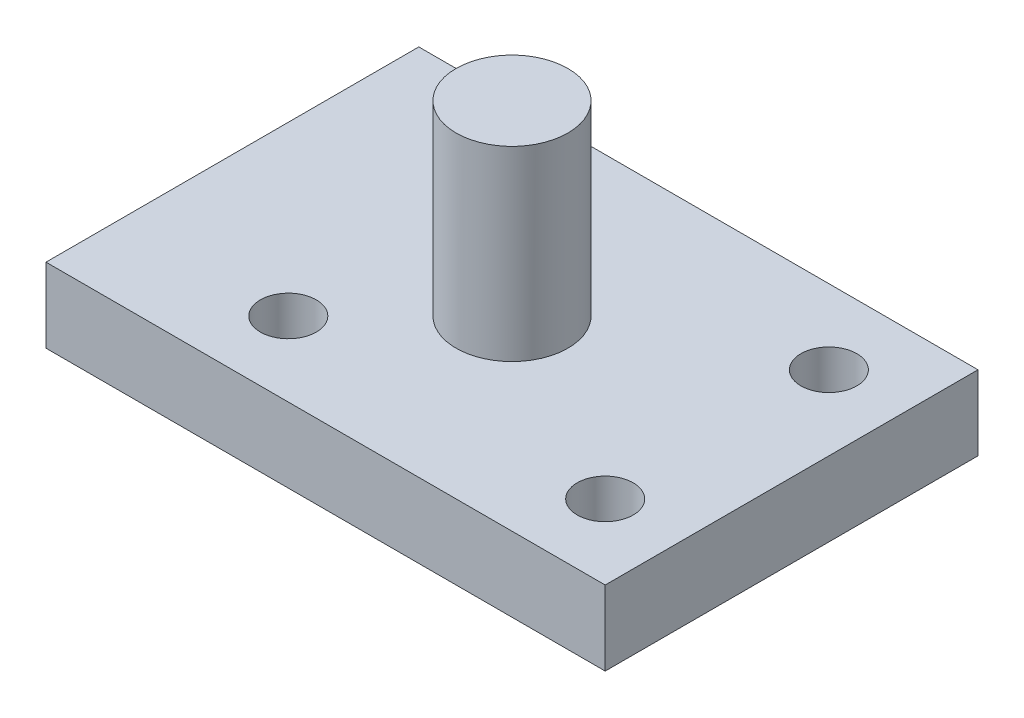
ISO-10303-21;
HEADER;
FILE_DESCRIPTION(('STEP AP214'),'2;1');
FILE_NAME('part.step','',(''),(''),'','','');
FILE_SCHEMA(('AUTOMOTIVE_DESIGN { 1 0 10303 214 1 1 1 1 }'));
ENDSEC;
DATA;
#1=APPLICATION_CONTEXT('core data for automotive mechanical design processes');
#2=APPLICATION_PROTOCOL_DEFINITION('international standard','automotive_design',2000,#1);
#3=PRODUCT_CONTEXT('',#1,'mechanical');
#4=PRODUCT('Part','Part','',(#3));
#5=PRODUCT_RELATED_PRODUCT_CATEGORY('part','',(#4));
#6=PRODUCT_DEFINITION_FORMATION('','',#4);
#7=PRODUCT_DEFINITION_CONTEXT('part definition',#1,'design');
#8=PRODUCT_DEFINITION('design','',#6,#7);
#9=PRODUCT_DEFINITION_SHAPE('','',#8);
#10=(LENGTH_UNIT() NAMED_UNIT(*) SI_UNIT(.MILLI.,.METRE.));
#11=(NAMED_UNIT(*) PLANE_ANGLE_UNIT() SI_UNIT($,.RADIAN.));
#12=(NAMED_UNIT(*) SI_UNIT($,.STERADIAN.) SOLID_ANGLE_UNIT());
#13=UNCERTAINTY_MEASURE_WITH_UNIT(LENGTH_MEASURE(1.E-05),#10,'distance_accuracy_value','');
#14=(GEOMETRIC_REPRESENTATION_CONTEXT(3) GLOBAL_UNCERTAINTY_ASSIGNED_CONTEXT((#13)) GLOBAL_UNIT_ASSIGNED_CONTEXT((#10,
#11,#12)) REPRESENTATION_CONTEXT('',''));
#15=CARTESIAN_POINT('',(0.,0.,0.));
#16=DIRECTION('',(0.,0.,1.));
#17=DIRECTION('',(1.,0.,0.));
#18=AXIS2_PLACEMENT_3D('',#15,#16,#17);
#19=CARTESIAN_POINT('',(0.,20.,0.));
#20=DIRECTION('',(0.,-1.,0.));
#21=DIRECTION('',(0.,0.,-1.));
#22=AXIS2_PLACEMENT_3D('',#19,#20,#21);
#23=PLANE('',#22);
#24=CARTESIAN_POINT('',(-30.,20.,30.));
#25=DIRECTION('',(0.,1.,0.));
#26=DIRECTION('',(0.,0.,1.));
#27=AXIS2_PLACEMENT_3D('',#24,#25,#26);
#28=CIRCLE('',#27,7.5);
#29=CARTESIAN_POINT('',(-30.,20.,37.5));
#30=VERTEX_POINT('',#29);
#31=EDGE_CURVE('E160',#30,#30,#28,.T.);
#32=ORIENTED_EDGE('',*,*,#31,.F.);
#33=EDGE_LOOP('',(#32));
#34=FACE_BOUND('',#33,.T.);
#35=CARTESIAN_POINT('',(55.,20.,30.));
#36=DIRECTION('',(0.,1.,0.));
#37=DIRECTION('',(0.,0.,1.));
#38=AXIS2_PLACEMENT_3D('',#35,#36,#37);
#39=CIRCLE('',#38,7.5);
#40=CARTESIAN_POINT('',(55.,20.,37.5));
#41=VERTEX_POINT('',#40);
#42=EDGE_CURVE('E162',#41,#41,#39,.T.);
#43=ORIENTED_EDGE('',*,*,#42,.F.);
#44=EDGE_LOOP('',(#43));
#45=FACE_BOUND('',#44,.T.);
#46=CARTESIAN_POINT('',(55.,20.,-30.));
#47=DIRECTION('',(0.,1.,0.));
#48=DIRECTION('',(0.,0.,1.));
#49=AXIS2_PLACEMENT_3D('',#46,#47,#48);
#50=CIRCLE('',#49,7.5);
#51=CARTESIAN_POINT('',(55.,20.,-22.5));
#52=VERTEX_POINT('',#51);
#53=EDGE_CURVE('E168',#52,#52,#50,.T.);
#54=ORIENTED_EDGE('',*,*,#53,.F.);
#55=EDGE_LOOP('',(#54));
#56=FACE_BOUND('',#55,.T.);
#57=CARTESIAN_POINT('',(-30.,20.,-30.));
#58=DIRECTION('',(0.,1.,0.));
#59=DIRECTION('',(0.,0.,1.));
#60=AXIS2_PLACEMENT_3D('',#57,#58,#59);
#61=CIRCLE('',#60,7.5);
#62=CARTESIAN_POINT('',(-30.,20.,-22.5));
#63=VERTEX_POINT('',#62);
#64=EDGE_CURVE('E174',#63,#63,#61,.T.);
#65=ORIENTED_EDGE('',*,*,#64,.F.);
#66=EDGE_LOOP('',(#65));
#67=FACE_BOUND('',#66,.T.);
#68=DIRECTION('',(0.,0.,-1.));
#69=VECTOR('',#68,1.);
#70=CARTESIAN_POINT('',(75.,20.,50.));
#71=LINE('',#70,#69);
#72=CARTESIAN_POINT('',(75.,20.,50.));
#73=VERTEX_POINT('',#72);
#74=CARTESIAN_POINT('',(75.,20.,-50.));
#75=VERTEX_POINT('',#74);
#76=EDGE_CURVE('E86',#73,#75,#71,.T.);
#77=ORIENTED_EDGE('',*,*,#76,.T.);
#78=DIRECTION('',(-1.,0.,0.));
#79=VECTOR('',#78,1.);
#80=CARTESIAN_POINT('',(-75.,20.,-50.));
#81=LINE('',#80,#79);
#82=CARTESIAN_POINT('',(-75.,20.,-50.));
#83=VERTEX_POINT('',#82);
#84=EDGE_CURVE('E81',#75,#83,#81,.T.);
#85=ORIENTED_EDGE('',*,*,#84,.T.);
#86=DIRECTION('',(0.,0.,1.));
#87=VECTOR('',#86,1.);
#88=CARTESIAN_POINT('',(-75.,20.,50.));
#89=LINE('',#88,#87);
#90=CARTESIAN_POINT('',(-75.,20.,50.));
#91=VERTEX_POINT('',#90);
#92=EDGE_CURVE('E84',#83,#91,#89,.T.);
#93=ORIENTED_EDGE('',*,*,#92,.T.);
#94=DIRECTION('',(1.,0.,0.));
#95=VECTOR('',#94,1.);
#96=CARTESIAN_POINT('',(-75.,20.,50.));
#97=LINE('',#96,#95);
#98=EDGE_CURVE('E50',#91,#73,#97,.T.);
#99=ORIENTED_EDGE('',*,*,#98,.T.);
#100=EDGE_LOOP('',(#77,#85,#93,#99));
#101=FACE_BOUND('',#100,.T.);
#102=CARTESIAN_POINT('',(0.,20.,0.));
#103=DIRECTION('',(0.,-1.,0.));
#104=DIRECTION('',(0.,0.,-1.));
#105=AXIS2_PLACEMENT_3D('',#102,#103,#104);
#106=CIRCLE('',#105,15.);
#107=CARTESIAN_POINT('',(0.,20.,-15.));
#108=VERTEX_POINT('',#107);
#109=EDGE_CURVE('E11',#108,#108,#106,.F.);
#110=ORIENTED_EDGE('',*,*,#109,.F.);
#111=EDGE_LOOP('',(#110));
#112=FACE_BOUND('',#111,.T.);
#113=ADVANCED_FACE('F33',(#34,#45,#56,#67,#101,#112),#23,.F.);
#114=CARTESIAN_POINT('',(75.,20.,50.));
#115=DIRECTION('',(-1.,0.,0.));
#116=DIRECTION('',(0.,0.,1.));
#117=AXIS2_PLACEMENT_3D('',#114,#115,#116);
#118=PLANE('',#117);
#119=DIRECTION('',(0.,0.,-1.));
#120=VECTOR('',#119,1.);
#121=CARTESIAN_POINT('',(75.,0.,50.));
#122=LINE('',#121,#120);
#123=CARTESIAN_POINT('',(75.,0.,50.));
#124=VERTEX_POINT('',#123);
#125=CARTESIAN_POINT('',(75.,0.,-50.));
#126=VERTEX_POINT('',#125);
#127=EDGE_CURVE('E100',#124,#126,#122,.T.);
#128=ORIENTED_EDGE('',*,*,#127,.T.);
#129=DIRECTION('',(0.,-1.,0.));
#130=VECTOR('',#129,1.);
#131=CARTESIAN_POINT('',(75.,20.,-50.));
#132=LINE('',#131,#130);
#133=EDGE_CURVE('E42',#75,#126,#132,.T.);
#134=ORIENTED_EDGE('',*,*,#133,.F.);
#135=ORIENTED_EDGE('',*,*,#76,.F.);
#136=DIRECTION('',(0.,-1.,0.));
#137=VECTOR('',#136,1.);
#138=CARTESIAN_POINT('',(75.,20.,50.));
#139=LINE('',#138,#137);
#140=EDGE_CURVE('E96',#73,#124,#139,.T.);
#141=ORIENTED_EDGE('',*,*,#140,.T.);
#142=EDGE_LOOP('',(#128,#134,#135,#141));
#143=FACE_BOUND('',#142,.T.);
#144=ADVANCED_FACE('F35',(#143),#118,.F.);
#145=CARTESIAN_POINT('',(-75.,20.,-50.));
#146=DIRECTION('',(0.,0.,1.));
#147=DIRECTION('',(1.,0.,0.));
#148=AXIS2_PLACEMENT_3D('',#145,#146,#147);
#149=PLANE('',#148);
#150=DIRECTION('',(-1.,0.,0.));
#151=VECTOR('',#150,1.);
#152=CARTESIAN_POINT('',(-75.,0.,-50.));
#153=LINE('',#152,#151);
#154=CARTESIAN_POINT('',(-75.,0.,-50.));
#155=VERTEX_POINT('',#154);
#156=EDGE_CURVE('E91',#126,#155,#153,.T.);
#157=ORIENTED_EDGE('',*,*,#156,.T.);
#158=DIRECTION('',(0.,-1.,0.));
#159=VECTOR('',#158,1.);
#160=CARTESIAN_POINT('',(-75.,20.,-50.));
#161=LINE('',#160,#159);
#162=EDGE_CURVE('E89',#83,#155,#161,.T.);
#163=ORIENTED_EDGE('',*,*,#162,.F.);
#164=ORIENTED_EDGE('',*,*,#84,.F.);
#165=ORIENTED_EDGE('',*,*,#133,.T.);
#166=EDGE_LOOP('',(#157,#163,#164,#165));
#167=FACE_BOUND('',#166,.T.);
#168=ADVANCED_FACE('F90',(#167),#149,.F.);
#169=CARTESIAN_POINT('',(-75.,20.,50.));
#170=DIRECTION('',(1.,0.,0.));
#171=DIRECTION('',(0.,0.,-1.));
#172=AXIS2_PLACEMENT_3D('',#169,#170,#171);
#173=PLANE('',#172);
#174=DIRECTION('',(0.,0.,1.));
#175=VECTOR('',#174,1.);
#176=CARTESIAN_POINT('',(-75.,0.,50.));
#177=LINE('',#176,#175);
#178=CARTESIAN_POINT('',(-75.,0.,50.));
#179=VERTEX_POINT('',#178);
#180=EDGE_CURVE('E67',#155,#179,#177,.T.);
#181=ORIENTED_EDGE('',*,*,#180,.T.);
#182=DIRECTION('',(0.,-1.,0.));
#183=VECTOR('',#182,1.);
#184=CARTESIAN_POINT('',(-75.,20.,50.));
#185=LINE('',#184,#183);
#186=EDGE_CURVE('E92',#91,#179,#185,.T.);
#187=ORIENTED_EDGE('',*,*,#186,.F.);
#188=ORIENTED_EDGE('',*,*,#92,.F.);
#189=ORIENTED_EDGE('',*,*,#162,.T.);
#190=EDGE_LOOP('',(#181,#187,#188,#189));
#191=FACE_BOUND('',#190,.T.);
#192=ADVANCED_FACE('F94',(#191),#173,.F.);
#193=CARTESIAN_POINT('',(-75.,20.,50.));
#194=DIRECTION('',(0.,0.,-1.));
#195=DIRECTION('',(-1.,0.,0.));
#196=AXIS2_PLACEMENT_3D('',#193,#194,#195);
#197=PLANE('',#196);
#198=DIRECTION('',(1.,0.,0.));
#199=VECTOR('',#198,1.);
#200=CARTESIAN_POINT('',(-75.,0.,50.));
#201=LINE('',#200,#199);
#202=EDGE_CURVE('E73',#179,#124,#201,.T.);
#203=ORIENTED_EDGE('',*,*,#202,.T.);
#204=ORIENTED_EDGE('',*,*,#140,.F.);
#205=ORIENTED_EDGE('',*,*,#98,.F.);
#206=ORIENTED_EDGE('',*,*,#186,.T.);
#207=EDGE_LOOP('',(#203,#204,#205,#206));
#208=FACE_BOUND('',#207,.T.);
#209=ADVANCED_FACE('F114',(#208),#197,.F.);
#210=CARTESIAN_POINT('',(0.,0.,0.));
#211=DIRECTION('',(0.,-1.,0.));
#212=DIRECTION('',(0.,0.,-1.));
#213=AXIS2_PLACEMENT_3D('',#210,#211,#212);
#214=PLANE('',#213);
#215=CARTESIAN_POINT('',(-30.,0.,30.));
#216=DIRECTION('',(0.,1.,0.));
#217=DIRECTION('',(0.,0.,1.));
#218=AXIS2_PLACEMENT_3D('',#215,#216,#217);
#219=CIRCLE('',#218,7.5);
#220=CARTESIAN_POINT('',(-30.,0.,37.5));
#221=VERTEX_POINT('',#220);
#222=EDGE_CURVE('E158',#221,#221,#219,.T.);
#223=ORIENTED_EDGE('',*,*,#222,.T.);
#224=EDGE_LOOP('',(#223));
#225=FACE_BOUND('',#224,.T.);
#226=CARTESIAN_POINT('',(55.,0.,30.));
#227=DIRECTION('',(0.,1.,0.));
#228=DIRECTION('',(0.,0.,1.));
#229=AXIS2_PLACEMENT_3D('',#226,#227,#228);
#230=CIRCLE('',#229,7.5);
#231=CARTESIAN_POINT('',(55.,0.,37.5));
#232=VERTEX_POINT('',#231);
#233=EDGE_CURVE('E165',#232,#232,#230,.T.);
#234=ORIENTED_EDGE('',*,*,#233,.T.);
#235=EDGE_LOOP('',(#234));
#236=FACE_BOUND('',#235,.T.);
#237=CARTESIAN_POINT('',(55.,0.,-30.));
#238=DIRECTION('',(0.,1.,0.));
#239=DIRECTION('',(0.,0.,1.));
#240=AXIS2_PLACEMENT_3D('',#237,#238,#239);
#241=CIRCLE('',#240,7.5);
#242=CARTESIAN_POINT('',(55.,0.,-22.5));
#243=VERTEX_POINT('',#242);
#244=EDGE_CURVE('E171',#243,#243,#241,.T.);
#245=ORIENTED_EDGE('',*,*,#244,.T.);
#246=EDGE_LOOP('',(#245));
#247=FACE_BOUND('',#246,.T.);
#248=CARTESIAN_POINT('',(-30.,0.,-30.));
#249=DIRECTION('',(0.,1.,0.));
#250=DIRECTION('',(0.,0.,1.));
#251=AXIS2_PLACEMENT_3D('',#248,#249,#250);
#252=CIRCLE('',#251,7.5);
#253=CARTESIAN_POINT('',(-30.,0.,-22.5));
#254=VERTEX_POINT('',#253);
#255=EDGE_CURVE('E177',#254,#254,#252,.T.);
#256=ORIENTED_EDGE('',*,*,#255,.T.);
#257=EDGE_LOOP('',(#256));
#258=FACE_BOUND('',#257,.T.);
#259=ORIENTED_EDGE('',*,*,#127,.F.);
#260=ORIENTED_EDGE('',*,*,#202,.F.);
#261=ORIENTED_EDGE('',*,*,#180,.F.);
#262=ORIENTED_EDGE('',*,*,#156,.F.);
#263=EDGE_LOOP('',(#259,#260,#261,#262));
#264=FACE_BOUND('',#263,.T.);
#265=ADVANCED_FACE('F111',(#225,#236,#247,#258,#264),#214,.T.);
#266=CARTESIAN_POINT('',(0.,70.,0.));
#267=DIRECTION('',(0.,-1.,0.));
#268=DIRECTION('',(0.,0.,-1.));
#269=AXIS2_PLACEMENT_3D('',#266,#267,#268);
#270=CYLINDRICAL_SURFACE('',#269,15.);
#271=CARTESIAN_POINT('',(0.,70.,0.));
#272=DIRECTION('',(0.,1.,0.));
#273=DIRECTION('',(0.,0.,1.));
#274=AXIS2_PLACEMENT_3D('',#271,#272,#273);
#275=CIRCLE('',#274,15.);
#276=CARTESIAN_POINT('',(0.,70.,15.));
#277=VERTEX_POINT('',#276);
#278=EDGE_CURVE('E103',#277,#277,#275,.T.);
#279=ORIENTED_EDGE('',*,*,#278,.F.);
#280=EDGE_LOOP('',(#279));
#281=FACE_BOUND('',#280,.T.);
#282=ORIENTED_EDGE('',*,*,#109,.T.);
#283=EDGE_LOOP('',(#282));
#284=FACE_BOUND('',#283,.T.);
#285=ADVANCED_FACE('F113',(#281,#284),#270,.T.);
#286=CARTESIAN_POINT('',(0.,70.,0.));
#287=DIRECTION('',(0.,1.,0.));
#288=DIRECTION('',(0.,0.,1.));
#289=AXIS2_PLACEMENT_3D('',#286,#287,#288);
#290=PLANE('',#289);
#291=ORIENTED_EDGE('',*,*,#278,.T.);
#292=EDGE_LOOP('',(#291));
#293=FACE_BOUND('',#292,.T.);
#294=ADVANCED_FACE('F121',(#293),#290,.T.);
#295=CARTESIAN_POINT('',(-30.,0.,-30.));
#296=DIRECTION('',(0.,1.,0.));
#297=DIRECTION('',(0.,0.,1.));
#298=AXIS2_PLACEMENT_3D('',#295,#296,#297);
#299=CYLINDRICAL_SURFACE('',#298,7.5);
#300=ORIENTED_EDGE('',*,*,#255,.F.);
#301=EDGE_LOOP('',(#300));
#302=FACE_BOUND('',#301,.T.);
#303=ORIENTED_EDGE('',*,*,#64,.T.);
#304=EDGE_LOOP('',(#303));
#305=FACE_BOUND('',#304,.T.);
#306=ADVANCED_FACE('F138',(#302,#305),#299,.F.);
#307=CARTESIAN_POINT('',(55.,0.,-30.));
#308=DIRECTION('',(0.,1.,0.));
#309=DIRECTION('',(0.,0.,1.));
#310=AXIS2_PLACEMENT_3D('',#307,#308,#309);
#311=CYLINDRICAL_SURFACE('',#310,7.5);
#312=ORIENTED_EDGE('',*,*,#244,.F.);
#313=EDGE_LOOP('',(#312));
#314=FACE_BOUND('',#313,.T.);
#315=ORIENTED_EDGE('',*,*,#53,.T.);
#316=EDGE_LOOP('',(#315));
#317=FACE_BOUND('',#316,.T.);
#318=ADVANCED_FACE('F142',(#314,#317),#311,.F.);
#319=CARTESIAN_POINT('',(55.,0.,30.));
#320=DIRECTION('',(0.,1.,0.));
#321=DIRECTION('',(0.,0.,1.));
#322=AXIS2_PLACEMENT_3D('',#319,#320,#321);
#323=CYLINDRICAL_SURFACE('',#322,7.5);
#324=ORIENTED_EDGE('',*,*,#233,.F.);
#325=EDGE_LOOP('',(#324));
#326=FACE_BOUND('',#325,.T.);
#327=ORIENTED_EDGE('',*,*,#42,.T.);
#328=EDGE_LOOP('',(#327));
#329=FACE_BOUND('',#328,.T.);
#330=ADVANCED_FACE('F146',(#326,#329),#323,.F.);
#331=CARTESIAN_POINT('',(-30.,0.,30.));
#332=DIRECTION('',(0.,1.,0.));
#333=DIRECTION('',(0.,0.,1.));
#334=AXIS2_PLACEMENT_3D('',#331,#332,#333);
#335=CYLINDRICAL_SURFACE('',#334,7.5);
#336=ORIENTED_EDGE('',*,*,#222,.F.);
#337=EDGE_LOOP('',(#336));
#338=FACE_BOUND('',#337,.T.);
#339=ORIENTED_EDGE('',*,*,#31,.T.);
#340=EDGE_LOOP('',(#339));
#341=FACE_BOUND('',#340,.T.);
#342=ADVANCED_FACE('F150',(#338,#341),#335,.F.);
#343=CLOSED_SHELL('',(#113,#144,#168,#192,#209,#265,#285,#294,#306,#318,#330,#342));
#344=MANIFOLD_SOLID_BREP('B2',#343);
#345=ADVANCED_BREP_SHAPE_REPRESENTATION('',(#18,#344),#14);
#346=SHAPE_DEFINITION_REPRESENTATION(#9,#345);
ENDSEC;
END-ISO-10303-21;
